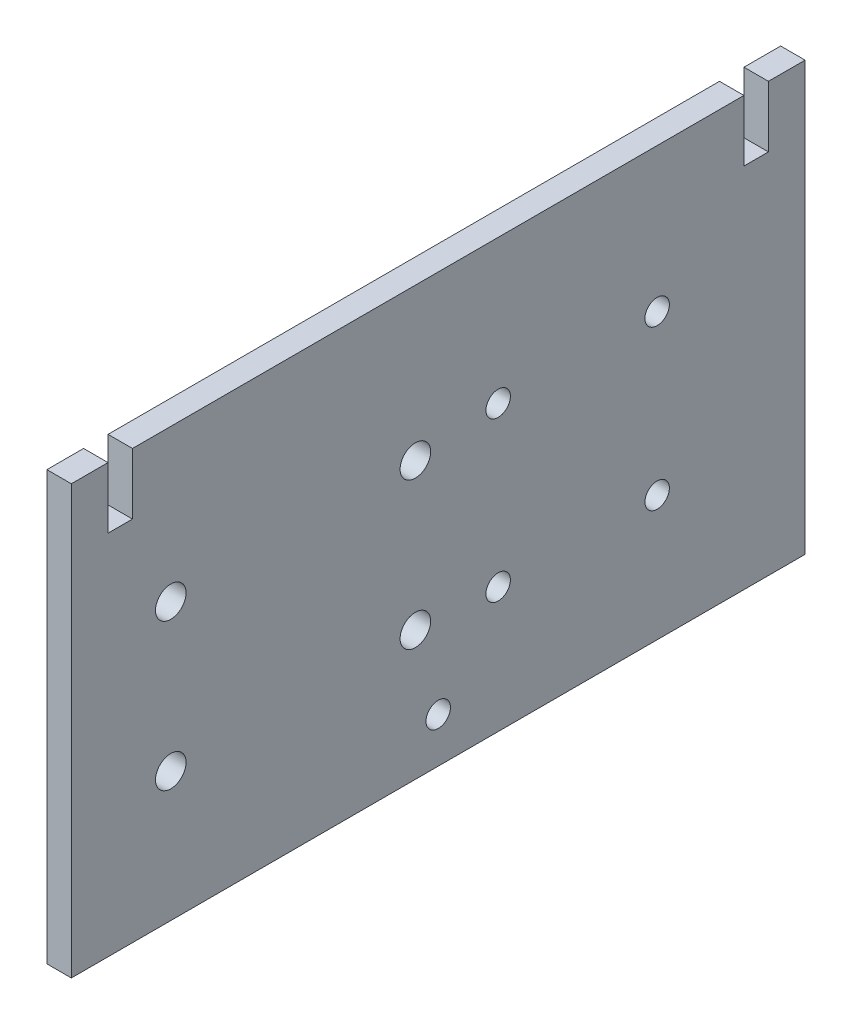
ISO-10303-21;
HEADER;
FILE_DESCRIPTION(('STEP AP214'),'2;1');
FILE_NAME('part.step','',(''),(''),'','','');
FILE_SCHEMA(('AUTOMOTIVE_DESIGN { 1 0 10303 214 1 1 1 1 }'));
ENDSEC;
DATA;
#1=APPLICATION_CONTEXT('core data for automotive mechanical design processes');
#2=APPLICATION_PROTOCOL_DEFINITION('international standard','automotive_design',2000,#1);
#3=PRODUCT_CONTEXT('',#1,'mechanical');
#4=PRODUCT('Part','Part','',(#3));
#5=PRODUCT_RELATED_PRODUCT_CATEGORY('part','',(#4));
#6=PRODUCT_DEFINITION_FORMATION('','',#4);
#7=PRODUCT_DEFINITION_CONTEXT('part definition',#1,'design');
#8=PRODUCT_DEFINITION('design','',#6,#7);
#9=PRODUCT_DEFINITION_SHAPE('','',#8);
#10=(LENGTH_UNIT() NAMED_UNIT(*) SI_UNIT(.MILLI.,.METRE.));
#11=(NAMED_UNIT(*) PLANE_ANGLE_UNIT() SI_UNIT($,.RADIAN.));
#12=(NAMED_UNIT(*) SI_UNIT($,.STERADIAN.) SOLID_ANGLE_UNIT());
#13=UNCERTAINTY_MEASURE_WITH_UNIT(LENGTH_MEASURE(1.E-05),#10,'distance_accuracy_value','');
#14=(GEOMETRIC_REPRESENTATION_CONTEXT(3) GLOBAL_UNCERTAINTY_ASSIGNED_CONTEXT((#13)) GLOBAL_UNIT_ASSIGNED_CONTEXT((#10,
#11,#12)) REPRESENTATION_CONTEXT('',''));
#15=CARTESIAN_POINT('',(0.,0.,0.));
#16=DIRECTION('',(0.,0.,1.));
#17=DIRECTION('',(1.,0.,0.));
#18=AXIS2_PLACEMENT_3D('',#15,#16,#17);
#19=CARTESIAN_POINT('',(4.,35.,60.));
#20=DIRECTION('',(0.,-1.,0.));
#21=DIRECTION('',(0.,0.,-1.));
#22=AXIS2_PLACEMENT_3D('',#19,#20,#21);
#23=PLANE('',#22);
#24=DIRECTION('',(0.,0.,1.));
#25=VECTOR('',#24,1.);
#26=CARTESIAN_POINT('',(4.,35.,60.));
#27=LINE('',#26,#25);
#28=CARTESIAN_POINT('',(4.,35.,-50.));
#29=VERTEX_POINT('',#28);
#30=CARTESIAN_POINT('',(4.,35.,50.));
#31=VERTEX_POINT('',#30);
#32=EDGE_CURVE('E196',#29,#31,#27,.T.);
#33=ORIENTED_EDGE('',*,*,#32,.F.);
#34=DIRECTION('',(1.,0.,0.));
#35=VECTOR('',#34,1.);
#36=CARTESIAN_POINT('',(0.,35.,-50.));
#37=LINE('',#36,#35);
#38=CARTESIAN_POINT('',(0.,35.,-50.));
#39=VERTEX_POINT('',#38);
#40=EDGE_CURVE('E156',#39,#29,#37,.T.);
#41=ORIENTED_EDGE('',*,*,#40,.F.);
#42=DIRECTION('',(0.,0.,1.));
#43=VECTOR('',#42,1.);
#44=CARTESIAN_POINT('',(0.,35.,60.));
#45=LINE('',#44,#43);
#46=CARTESIAN_POINT('',(0.,35.,50.));
#47=VERTEX_POINT('',#46);
#48=EDGE_CURVE('E143',#39,#47,#45,.T.);
#49=ORIENTED_EDGE('',*,*,#48,.T.);
#50=DIRECTION('',(1.,0.,0.));
#51=VECTOR('',#50,1.);
#52=CARTESIAN_POINT('',(0.,35.,50.));
#53=LINE('',#52,#51);
#54=EDGE_CURVE('E170',#47,#31,#53,.T.);
#55=ORIENTED_EDGE('',*,*,#54,.T.);
#56=EDGE_LOOP('',(#33,#41,#49,#55));
#57=FACE_BOUND('',#56,.T.);
#58=ADVANCED_FACE('F34',(#57),#23,.F.);
#59=CARTESIAN_POINT('',(0.,35.,-60.));
#60=VERTEX_POINT('',#59);
#61=CARTESIAN_POINT('',(0.,35.,-54.));
#62=VERTEX_POINT('',#61);
#63=EDGE_CURVE('E204',#60,#62,#45,.T.);
#64=ORIENTED_EDGE('',*,*,#63,.T.);
#65=DIRECTION('',(1.,0.,0.));
#66=VECTOR('',#65,1.);
#67=CARTESIAN_POINT('',(0.,35.,-54.));
#68=LINE('',#67,#66);
#69=CARTESIAN_POINT('',(4.,35.,-54.));
#70=VERTEX_POINT('',#69);
#71=EDGE_CURVE('E159',#62,#70,#68,.T.);
#72=ORIENTED_EDGE('',*,*,#71,.T.);
#73=CARTESIAN_POINT('',(4.,35.,-60.));
#74=VERTEX_POINT('',#73);
#75=EDGE_CURVE('E192',#74,#70,#27,.T.);
#76=ORIENTED_EDGE('',*,*,#75,.F.);
#77=DIRECTION('',(-1.,0.,0.));
#78=VECTOR('',#77,1.);
#79=CARTESIAN_POINT('',(4.,35.,-60.));
#80=LINE('',#79,#78);
#81=EDGE_CURVE('E11',#74,#60,#80,.T.);
#82=ORIENTED_EDGE('',*,*,#81,.T.);
#83=EDGE_LOOP('',(#64,#72,#76,#82));
#84=FACE_BOUND('',#83,.T.);
#85=ADVANCED_FACE('F260',(#84),#23,.F.);
#86=CARTESIAN_POINT('',(4.,-35.,-60.));
#87=DIRECTION('',(0.,0.,1.));
#88=DIRECTION('',(0.,-1.,0.));
#89=AXIS2_PLACEMENT_3D('',#86,#87,#88);
#90=PLANE('',#89);
#91=DIRECTION('',(0.,1.,0.));
#92=VECTOR('',#91,1.);
#93=CARTESIAN_POINT('',(0.,-35.,-60.));
#94=LINE('',#93,#92);
#95=CARTESIAN_POINT('',(0.,-35.,-60.));
#96=VERTEX_POINT('',#95);
#97=EDGE_CURVE('E180',#96,#60,#94,.T.);
#98=ORIENTED_EDGE('',*,*,#97,.T.);
#99=ORIENTED_EDGE('',*,*,#81,.F.);
#100=DIRECTION('',(0.,1.,0.));
#101=VECTOR('',#100,1.);
#102=CARTESIAN_POINT('',(4.,-35.,-60.));
#103=LINE('',#102,#101);
#104=CARTESIAN_POINT('',(4.,-35.,-60.));
#105=VERTEX_POINT('',#104);
#106=EDGE_CURVE('E187',#105,#74,#103,.T.);
#107=ORIENTED_EDGE('',*,*,#106,.F.);
#108=DIRECTION('',(-1.,0.,0.));
#109=VECTOR('',#108,1.);
#110=CARTESIAN_POINT('',(4.,-35.,-60.));
#111=LINE('',#110,#109);
#112=EDGE_CURVE('E200',#105,#96,#111,.T.);
#113=ORIENTED_EDGE('',*,*,#112,.T.);
#114=EDGE_LOOP('',(#98,#99,#107,#113));
#115=FACE_BOUND('',#114,.T.);
#116=ADVANCED_FACE('F36',(#115),#90,.F.);
#117=CARTESIAN_POINT('',(4.,35.,54.));
#118=VERTEX_POINT('',#117);
#119=CARTESIAN_POINT('',(4.,35.,60.));
#120=VERTEX_POINT('',#119);
#121=EDGE_CURVE('E190',#118,#120,#27,.T.);
#122=ORIENTED_EDGE('',*,*,#121,.F.);
#123=DIRECTION('',(1.,0.,0.));
#124=VECTOR('',#123,1.);
#125=CARTESIAN_POINT('',(0.,35.,54.));
#126=LINE('',#125,#124);
#127=CARTESIAN_POINT('',(0.,35.,54.));
#128=VERTEX_POINT('',#127);
#129=EDGE_CURVE('E183',#128,#118,#126,.T.);
#130=ORIENTED_EDGE('',*,*,#129,.F.);
#131=CARTESIAN_POINT('',(0.,35.,60.));
#132=VERTEX_POINT('',#131);
#133=EDGE_CURVE('E203',#128,#132,#45,.T.);
#134=ORIENTED_EDGE('',*,*,#133,.T.);
#135=DIRECTION('',(-1.,0.,0.));
#136=VECTOR('',#135,1.);
#137=CARTESIAN_POINT('',(4.,35.,60.));
#138=LINE('',#137,#136);
#139=EDGE_CURVE('E42',#120,#132,#138,.T.);
#140=ORIENTED_EDGE('',*,*,#139,.F.);
#141=EDGE_LOOP('',(#122,#130,#134,#140));
#142=FACE_BOUND('',#141,.T.);
#143=ADVANCED_FACE('F246',(#142),#23,.F.);
#144=CARTESIAN_POINT('',(4.,-35.,60.));
#145=DIRECTION('',(0.,0.,-1.));
#146=DIRECTION('',(0.,1.,0.));
#147=AXIS2_PLACEMENT_3D('',#144,#145,#146);
#148=PLANE('',#147);
#149=DIRECTION('',(0.,-1.,0.));
#150=VECTOR('',#149,1.);
#151=CARTESIAN_POINT('',(0.,-35.,60.));
#152=LINE('',#151,#150);
#153=CARTESIAN_POINT('',(0.,-35.,60.));
#154=VERTEX_POINT('',#153);
#155=EDGE_CURVE('E207',#132,#154,#152,.T.);
#156=ORIENTED_EDGE('',*,*,#155,.T.);
#157=DIRECTION('',(-1.,0.,0.));
#158=VECTOR('',#157,1.);
#159=CARTESIAN_POINT('',(4.,-35.,60.));
#160=LINE('',#159,#158);
#161=CARTESIAN_POINT('',(4.,-35.,60.));
#162=VERTEX_POINT('',#161);
#163=EDGE_CURVE('E212',#162,#154,#160,.T.);
#164=ORIENTED_EDGE('',*,*,#163,.F.);
#165=DIRECTION('',(0.,-1.,0.));
#166=VECTOR('',#165,1.);
#167=CARTESIAN_POINT('',(4.,-35.,60.));
#168=LINE('',#167,#166);
#169=EDGE_CURVE('E195',#120,#162,#168,.T.);
#170=ORIENTED_EDGE('',*,*,#169,.F.);
#171=ORIENTED_EDGE('',*,*,#139,.T.);
#172=EDGE_LOOP('',(#156,#164,#170,#171));
#173=FACE_BOUND('',#172,.T.);
#174=ADVANCED_FACE('F219',(#173),#148,.F.);
#175=CARTESIAN_POINT('',(4.,-35.,60.));
#176=DIRECTION('',(0.,1.,0.));
#177=DIRECTION('',(0.,0.,1.));
#178=AXIS2_PLACEMENT_3D('',#175,#176,#177);
#179=PLANE('',#178);
#180=DIRECTION('',(0.,0.,-1.));
#181=VECTOR('',#180,1.);
#182=CARTESIAN_POINT('',(0.,-35.,60.));
#183=LINE('',#182,#181);
#184=EDGE_CURVE('E191',#154,#96,#183,.T.);
#185=ORIENTED_EDGE('',*,*,#184,.T.);
#186=ORIENTED_EDGE('',*,*,#112,.F.);
#187=DIRECTION('',(0.,0.,-1.));
#188=VECTOR('',#187,1.);
#189=CARTESIAN_POINT('',(4.,-35.,60.));
#190=LINE('',#189,#188);
#191=EDGE_CURVE('E198',#162,#105,#190,.T.);
#192=ORIENTED_EDGE('',*,*,#191,.F.);
#193=ORIENTED_EDGE('',*,*,#163,.T.);
#194=EDGE_LOOP('',(#185,#186,#192,#193));
#195=FACE_BOUND('',#194,.T.);
#196=ADVANCED_FACE('F228',(#195),#179,.F.);
#197=CARTESIAN_POINT('',(4.,0.,0.));
#198=DIRECTION('',(-1.,0.,0.));
#199=DIRECTION('',(0.,0.,1.));
#200=AXIS2_PLACEMENT_3D('',#197,#198,#199);
#201=PLANE('',#200);
#202=CARTESIAN_POINT('',(4.,-14.506000467976,-9.80309809957087));
#203=DIRECTION('',(1.,0.,0.));
#204=DIRECTION('',(0.,0.,-1.));
#205=AXIS2_PLACEMENT_3D('',#202,#203,#204);
#206=CIRCLE('',#205,2.);
#207=CARTESIAN_POINT('',(4.,-14.506000467976,-11.8030980995709));
#208=VERTEX_POINT('',#207);
#209=EDGE_CURVE('E441',#208,#208,#206,.T.);
#210=ORIENTED_EDGE('',*,*,#209,.F.);
#211=EDGE_LOOP('',(#210));
#212=FACE_BOUND('',#211,.T.);
#213=CARTESIAN_POINT('',(4.,-14.506000467976,-35.8030980995709));
#214=DIRECTION('',(1.,0.,0.));
#215=DIRECTION('',(0.,0.,-1.));
#216=AXIS2_PLACEMENT_3D('',#213,#214,#215);
#217=CIRCLE('',#216,2.);
#218=CARTESIAN_POINT('',(4.,-14.506000467976,-37.8030980995709));
#219=VERTEX_POINT('',#218);
#220=EDGE_CURVE('E443',#219,#219,#217,.T.);
#221=ORIENTED_EDGE('',*,*,#220,.F.);
#222=EDGE_LOOP('',(#221));
#223=FACE_BOUND('',#222,.T.);
#224=CARTESIAN_POINT('',(4.,11.493999532024,-35.8030980995709));
#225=DIRECTION('',(1.,0.,0.));
#226=DIRECTION('',(0.,0.,-1.));
#227=AXIS2_PLACEMENT_3D('',#224,#225,#226);
#228=CIRCLE('',#227,2.);
#229=CARTESIAN_POINT('',(4.,11.493999532024,-37.8030980995709));
#230=VERTEX_POINT('',#229);
#231=EDGE_CURVE('E449',#230,#230,#228,.T.);
#232=ORIENTED_EDGE('',*,*,#231,.F.);
#233=EDGE_LOOP('',(#232));
#234=FACE_BOUND('',#233,.T.);
#235=CARTESIAN_POINT('',(4.,11.493999532024,-9.80309809957087));
#236=DIRECTION('',(1.,0.,0.));
#237=DIRECTION('',(0.,0.,-1.));
#238=AXIS2_PLACEMENT_3D('',#235,#236,#237);
#239=CIRCLE('',#238,2.);
#240=CARTESIAN_POINT('',(4.,11.493999532024,-11.8030980995709));
#241=VERTEX_POINT('',#240);
#242=EDGE_CURVE('E455',#241,#241,#239,.T.);
#243=ORIENTED_EDGE('',*,*,#242,.F.);
#244=EDGE_LOOP('',(#243));
#245=FACE_BOUND('',#244,.T.);
#246=CARTESIAN_POINT('',(4.,10.1722417389506,3.73750757894949));
#247=DIRECTION('',(1.,0.,0.));
#248=DIRECTION('',(0.,0.,-1.));
#249=AXIS2_PLACEMENT_3D('',#246,#247,#248);
#250=CIRCLE('',#249,2.5);
#251=CARTESIAN_POINT('',(4.,10.1722417389506,1.23750757894949));
#252=VERTEX_POINT('',#251);
#253=EDGE_CURVE('E461',#252,#252,#250,.T.);
#254=ORIENTED_EDGE('',*,*,#253,.F.);
#255=EDGE_LOOP('',(#254));
#256=FACE_BOUND('',#255,.T.);
#257=CARTESIAN_POINT('',(4.,-13.8277582610494,3.73750757894949));
#258=DIRECTION('',(1.,0.,0.));
#259=DIRECTION('',(0.,0.,-1.));
#260=AXIS2_PLACEMENT_3D('',#257,#258,#259);
#261=CIRCLE('',#260,2.5);
#262=CARTESIAN_POINT('',(4.,-13.8277582610494,1.23750757894949));
#263=VERTEX_POINT('',#262);
#264=EDGE_CURVE('E467',#263,#263,#261,.T.);
#265=ORIENTED_EDGE('',*,*,#264,.F.);
#266=EDGE_LOOP('',(#265));
#267=FACE_BOUND('',#266,.T.);
#268=CARTESIAN_POINT('',(4.,-13.8277582610494,43.7375075789495));
#269=DIRECTION('',(1.,0.,0.));
#270=DIRECTION('',(0.,0.,-1.));
#271=AXIS2_PLACEMENT_3D('',#268,#269,#270);
#272=CIRCLE('',#271,2.49999999999999);
#273=CARTESIAN_POINT('',(4.,-13.8277582610494,41.2375075789495));
#274=VERTEX_POINT('',#273);
#275=EDGE_CURVE('E473',#274,#274,#272,.T.);
#276=ORIENTED_EDGE('',*,*,#275,.F.);
#277=EDGE_LOOP('',(#276));
#278=FACE_BOUND('',#277,.T.);
#279=CARTESIAN_POINT('',(4.,10.1722417389506,43.7375075789495));
#280=DIRECTION('',(1.,0.,0.));
#281=DIRECTION('',(0.,0.,-1.));
#282=AXIS2_PLACEMENT_3D('',#279,#280,#281);
#283=CIRCLE('',#282,2.49999999999999);
#284=CARTESIAN_POINT('',(4.,10.1722417389506,41.2375075789495));
#285=VERTEX_POINT('',#284);
#286=EDGE_CURVE('E479',#285,#285,#283,.T.);
#287=ORIENTED_EDGE('',*,*,#286,.F.);
#288=EDGE_LOOP('',(#287));
#289=FACE_BOUND('',#288,.T.);
#290=CARTESIAN_POINT('',(4.,-27.6604928850881,0.));
#291=DIRECTION('',(1.,0.,0.));
#292=DIRECTION('',(0.,0.,-1.));
#293=AXIS2_PLACEMENT_3D('',#290,#291,#292);
#294=CIRCLE('',#293,2.);
#295=CARTESIAN_POINT('',(4.,-27.6604928850881,-2.));
#296=VERTEX_POINT('',#295);
#297=EDGE_CURVE('E149',#296,#296,#294,.T.);
#298=ORIENTED_EDGE('',*,*,#297,.F.);
#299=EDGE_LOOP('',(#298));
#300=FACE_BOUND('',#299,.T.);
#301=DIRECTION('',(0.,0.,-1.));
#302=VECTOR('',#301,1.);
#303=CARTESIAN_POINT('',(4.,25.,-50.));
#304=LINE('',#303,#302);
#305=CARTESIAN_POINT('',(4.,25.,-50.));
#306=VERTEX_POINT('',#305);
#307=CARTESIAN_POINT('',(4.,25.,-54.));
#308=VERTEX_POINT('',#307);
#309=EDGE_CURVE('E146',#306,#308,#304,.T.);
#310=ORIENTED_EDGE('',*,*,#309,.F.);
#311=DIRECTION('',(0.,-1.,0.));
#312=VECTOR('',#311,1.);
#313=CARTESIAN_POINT('',(4.,35.,-50.));
#314=LINE('',#313,#312);
#315=EDGE_CURVE('E129',#29,#306,#314,.T.);
#316=ORIENTED_EDGE('',*,*,#315,.F.);
#317=ORIENTED_EDGE('',*,*,#32,.T.);
#318=DIRECTION('',(0.,1.,0.));
#319=VECTOR('',#318,1.);
#320=CARTESIAN_POINT('',(4.,35.,50.));
#321=LINE('',#320,#319);
#322=CARTESIAN_POINT('',(4.,25.,50.));
#323=VERTEX_POINT('',#322);
#324=EDGE_CURVE('E158',#323,#31,#321,.T.);
#325=ORIENTED_EDGE('',*,*,#324,.F.);
#326=DIRECTION('',(0.,0.,-1.));
#327=VECTOR('',#326,1.);
#328=CARTESIAN_POINT('',(4.,25.,50.));
#329=LINE('',#328,#327);
#330=CARTESIAN_POINT('',(4.,25.,54.));
#331=VERTEX_POINT('',#330);
#332=EDGE_CURVE('E166',#331,#323,#329,.T.);
#333=ORIENTED_EDGE('',*,*,#332,.F.);
#334=DIRECTION('',(0.,-1.,0.));
#335=VECTOR('',#334,1.);
#336=CARTESIAN_POINT('',(4.,35.,54.));
#337=LINE('',#336,#335);
#338=EDGE_CURVE('E173',#118,#331,#337,.T.);
#339=ORIENTED_EDGE('',*,*,#338,.F.);
#340=ORIENTED_EDGE('',*,*,#121,.T.);
#341=ORIENTED_EDGE('',*,*,#169,.T.);
#342=ORIENTED_EDGE('',*,*,#191,.T.);
#343=ORIENTED_EDGE('',*,*,#106,.T.);
#344=ORIENTED_EDGE('',*,*,#75,.T.);
#345=DIRECTION('',(0.,1.,0.));
#346=VECTOR('',#345,1.);
#347=CARTESIAN_POINT('',(4.,35.,-54.));
#348=LINE('',#347,#346);
#349=EDGE_CURVE('E144',#308,#70,#348,.T.);
#350=ORIENTED_EDGE('',*,*,#349,.F.);
#351=EDGE_LOOP('',(#310,#316,#317,#325,#333,#339,#340,#341,#342,#343,#344,#350));
#352=FACE_BOUND('',#351,.T.);
#353=ADVANCED_FACE('F234',(#212,#223,#234,#245,#256,#267,#278,#289,#300,#352),#201,.F.);
#354=CARTESIAN_POINT('',(0.,0.,0.));
#355=DIRECTION('',(-1.,0.,0.));
#356=DIRECTION('',(0.,0.,1.));
#357=AXIS2_PLACEMENT_3D('',#354,#355,#356);
#358=PLANE('',#357);
#359=CARTESIAN_POINT('',(0.,-14.506000467976,-9.80309809957087));
#360=DIRECTION('',(1.,0.,0.));
#361=DIRECTION('',(0.,0.,-1.));
#362=AXIS2_PLACEMENT_3D('',#359,#360,#361);
#363=CIRCLE('',#362,2.);
#364=CARTESIAN_POINT('',(0.,-14.506000467976,-11.8030980995709));
#365=VERTEX_POINT('',#364);
#366=EDGE_CURVE('E438',#365,#365,#363,.T.);
#367=ORIENTED_EDGE('',*,*,#366,.T.);
#368=EDGE_LOOP('',(#367));
#369=FACE_BOUND('',#368,.T.);
#370=CARTESIAN_POINT('',(0.,-14.506000467976,-35.8030980995709));
#371=DIRECTION('',(1.,0.,0.));
#372=DIRECTION('',(0.,0.,-1.));
#373=AXIS2_PLACEMENT_3D('',#370,#371,#372);
#374=CIRCLE('',#373,2.);
#375=CARTESIAN_POINT('',(0.,-14.506000467976,-37.8030980995709));
#376=VERTEX_POINT('',#375);
#377=EDGE_CURVE('E446',#376,#376,#374,.T.);
#378=ORIENTED_EDGE('',*,*,#377,.T.);
#379=EDGE_LOOP('',(#378));
#380=FACE_BOUND('',#379,.T.);
#381=CARTESIAN_POINT('',(0.,11.493999532024,-35.8030980995709));
#382=DIRECTION('',(1.,0.,0.));
#383=DIRECTION('',(0.,0.,-1.));
#384=AXIS2_PLACEMENT_3D('',#381,#382,#383);
#385=CIRCLE('',#384,2.);
#386=CARTESIAN_POINT('',(0.,11.493999532024,-37.8030980995709));
#387=VERTEX_POINT('',#386);
#388=EDGE_CURVE('E452',#387,#387,#385,.T.);
#389=ORIENTED_EDGE('',*,*,#388,.T.);
#390=EDGE_LOOP('',(#389));
#391=FACE_BOUND('',#390,.T.);
#392=CARTESIAN_POINT('',(0.,11.493999532024,-9.80309809957087));
#393=DIRECTION('',(1.,0.,0.));
#394=DIRECTION('',(0.,0.,-1.));
#395=AXIS2_PLACEMENT_3D('',#392,#393,#394);
#396=CIRCLE('',#395,2.);
#397=CARTESIAN_POINT('',(0.,11.493999532024,-11.8030980995709));
#398=VERTEX_POINT('',#397);
#399=EDGE_CURVE('E458',#398,#398,#396,.T.);
#400=ORIENTED_EDGE('',*,*,#399,.T.);
#401=EDGE_LOOP('',(#400));
#402=FACE_BOUND('',#401,.T.);
#403=CARTESIAN_POINT('',(0.,10.1722417389506,3.73750757894949));
#404=DIRECTION('',(1.,0.,0.));
#405=DIRECTION('',(0.,0.,-1.));
#406=AXIS2_PLACEMENT_3D('',#403,#404,#405);
#407=CIRCLE('',#406,2.5);
#408=CARTESIAN_POINT('',(0.,10.1722417389506,1.23750757894949));
#409=VERTEX_POINT('',#408);
#410=EDGE_CURVE('E464',#409,#409,#407,.T.);
#411=ORIENTED_EDGE('',*,*,#410,.T.);
#412=EDGE_LOOP('',(#411));
#413=FACE_BOUND('',#412,.T.);
#414=CARTESIAN_POINT('',(0.,-13.8277582610494,3.73750757894949));
#415=DIRECTION('',(1.,0.,0.));
#416=DIRECTION('',(0.,0.,-1.));
#417=AXIS2_PLACEMENT_3D('',#414,#415,#416);
#418=CIRCLE('',#417,2.5);
#419=CARTESIAN_POINT('',(0.,-13.8277582610494,1.23750757894949));
#420=VERTEX_POINT('',#419);
#421=EDGE_CURVE('E470',#420,#420,#418,.T.);
#422=ORIENTED_EDGE('',*,*,#421,.T.);
#423=EDGE_LOOP('',(#422));
#424=FACE_BOUND('',#423,.T.);
#425=CARTESIAN_POINT('',(0.,-13.8277582610494,43.7375075789495));
#426=DIRECTION('',(1.,0.,0.));
#427=DIRECTION('',(0.,0.,-1.));
#428=AXIS2_PLACEMENT_3D('',#425,#426,#427);
#429=CIRCLE('',#428,2.49999999999999);
#430=CARTESIAN_POINT('',(0.,-13.8277582610494,41.2375075789495));
#431=VERTEX_POINT('',#430);
#432=EDGE_CURVE('E476',#431,#431,#429,.T.);
#433=ORIENTED_EDGE('',*,*,#432,.T.);
#434=EDGE_LOOP('',(#433));
#435=FACE_BOUND('',#434,.T.);
#436=CARTESIAN_POINT('',(0.,10.1722417389506,43.7375075789495));
#437=DIRECTION('',(1.,0.,0.));
#438=DIRECTION('',(0.,0.,-1.));
#439=AXIS2_PLACEMENT_3D('',#436,#437,#438);
#440=CIRCLE('',#439,2.49999999999999);
#441=CARTESIAN_POINT('',(0.,10.1722417389506,41.2375075789495));
#442=VERTEX_POINT('',#441);
#443=EDGE_CURVE('E482',#442,#442,#440,.T.);
#444=ORIENTED_EDGE('',*,*,#443,.T.);
#445=EDGE_LOOP('',(#444));
#446=FACE_BOUND('',#445,.T.);
#447=CARTESIAN_POINT('',(0.,-27.6604928850881,0.));
#448=DIRECTION('',(1.,0.,0.));
#449=DIRECTION('',(0.,0.,-1.));
#450=AXIS2_PLACEMENT_3D('',#447,#448,#449);
#451=CIRCLE('',#450,2.);
#452=CARTESIAN_POINT('',(0.,-27.6604928850881,-2.));
#453=VERTEX_POINT('',#452);
#454=EDGE_CURVE('E154',#453,#453,#451,.T.);
#455=ORIENTED_EDGE('',*,*,#454,.T.);
#456=EDGE_LOOP('',(#455));
#457=FACE_BOUND('',#456,.T.);
#458=DIRECTION('',(0.,-1.,0.));
#459=VECTOR('',#458,1.);
#460=CARTESIAN_POINT('',(0.,35.,-50.));
#461=LINE('',#460,#459);
#462=CARTESIAN_POINT('',(0.,25.,-50.));
#463=VERTEX_POINT('',#462);
#464=EDGE_CURVE('E126',#39,#463,#461,.T.);
#465=ORIENTED_EDGE('',*,*,#464,.T.);
#466=DIRECTION('',(0.,0.,-1.));
#467=VECTOR('',#466,1.);
#468=CARTESIAN_POINT('',(0.,25.,-50.));
#469=LINE('',#468,#467);
#470=CARTESIAN_POINT('',(0.,25.,-54.));
#471=VERTEX_POINT('',#470);
#472=EDGE_CURVE('E136',#463,#471,#469,.T.);
#473=ORIENTED_EDGE('',*,*,#472,.T.);
#474=DIRECTION('',(0.,1.,0.));
#475=VECTOR('',#474,1.);
#476=CARTESIAN_POINT('',(0.,35.,-54.));
#477=LINE('',#476,#475);
#478=EDGE_CURVE('E49',#471,#62,#477,.T.);
#479=ORIENTED_EDGE('',*,*,#478,.T.);
#480=ORIENTED_EDGE('',*,*,#63,.F.);
#481=ORIENTED_EDGE('',*,*,#97,.F.);
#482=ORIENTED_EDGE('',*,*,#184,.F.);
#483=ORIENTED_EDGE('',*,*,#155,.F.);
#484=ORIENTED_EDGE('',*,*,#133,.F.);
#485=DIRECTION('',(0.,-1.,0.));
#486=VECTOR('',#485,1.);
#487=CARTESIAN_POINT('',(0.,35.,54.));
#488=LINE('',#487,#486);
#489=CARTESIAN_POINT('',(0.,25.,54.));
#490=VERTEX_POINT('',#489);
#491=EDGE_CURVE('E165',#128,#490,#488,.T.);
#492=ORIENTED_EDGE('',*,*,#491,.T.);
#493=DIRECTION('',(0.,0.,-1.));
#494=VECTOR('',#493,1.);
#495=CARTESIAN_POINT('',(0.,25.,50.));
#496=LINE('',#495,#494);
#497=CARTESIAN_POINT('',(0.,25.,50.));
#498=VERTEX_POINT('',#497);
#499=EDGE_CURVE('E57',#490,#498,#496,.T.);
#500=ORIENTED_EDGE('',*,*,#499,.T.);
#501=DIRECTION('',(0.,1.,0.));
#502=VECTOR('',#501,1.);
#503=CARTESIAN_POINT('',(0.,35.,50.));
#504=LINE('',#503,#502);
#505=EDGE_CURVE('E163',#498,#47,#504,.T.);
#506=ORIENTED_EDGE('',*,*,#505,.T.);
#507=ORIENTED_EDGE('',*,*,#48,.F.);
#508=EDGE_LOOP('',(#465,#473,#479,#480,#481,#482,#483,#484,#492,#500,#506,#507));
#509=FACE_BOUND('',#508,.T.);
#510=ADVANCED_FACE('F141',(#369,#380,#391,#402,#413,#424,#435,#446,#457,#509),#358,.T.);
#511=CARTESIAN_POINT('',(0.,35.,50.));
#512=DIRECTION('',(0.,0.,-1.));
#513=DIRECTION('',(-1.,0.,0.));
#514=AXIS2_PLACEMENT_3D('',#511,#512,#513);
#515=PLANE('',#514);
#516=ORIENTED_EDGE('',*,*,#324,.T.);
#517=ORIENTED_EDGE('',*,*,#54,.F.);
#518=ORIENTED_EDGE('',*,*,#505,.F.);
#519=DIRECTION('',(1.,0.,0.));
#520=VECTOR('',#519,1.);
#521=CARTESIAN_POINT('',(0.,25.,50.));
#522=LINE('',#521,#520);
#523=EDGE_CURVE('E178',#498,#323,#522,.T.);
#524=ORIENTED_EDGE('',*,*,#523,.T.);
#525=EDGE_LOOP('',(#516,#517,#518,#524));
#526=FACE_BOUND('',#525,.T.);
#527=ADVANCED_FACE('F244',(#526),#515,.F.);
#528=CARTESIAN_POINT('',(0.,25.,50.));
#529=DIRECTION('',(0.,-1.,0.));
#530=DIRECTION('',(0.,0.,-1.));
#531=AXIS2_PLACEMENT_3D('',#528,#529,#530);
#532=PLANE('',#531);
#533=ORIENTED_EDGE('',*,*,#332,.T.);
#534=ORIENTED_EDGE('',*,*,#523,.F.);
#535=ORIENTED_EDGE('',*,*,#499,.F.);
#536=DIRECTION('',(1.,0.,0.));
#537=VECTOR('',#536,1.);
#538=CARTESIAN_POINT('',(0.,25.,54.));
#539=LINE('',#538,#537);
#540=EDGE_CURVE('E181',#490,#331,#539,.T.);
#541=ORIENTED_EDGE('',*,*,#540,.T.);
#542=EDGE_LOOP('',(#533,#534,#535,#541));
#543=FACE_BOUND('',#542,.T.);
#544=ADVANCED_FACE('F249',(#543),#532,.F.);
#545=CARTESIAN_POINT('',(0.,35.,54.));
#546=DIRECTION('',(0.,0.,1.));
#547=DIRECTION('',(1.,0.,0.));
#548=AXIS2_PLACEMENT_3D('',#545,#546,#547);
#549=PLANE('',#548);
#550=ORIENTED_EDGE('',*,*,#338,.T.);
#551=ORIENTED_EDGE('',*,*,#540,.F.);
#552=ORIENTED_EDGE('',*,*,#491,.F.);
#553=ORIENTED_EDGE('',*,*,#129,.T.);
#554=EDGE_LOOP('',(#550,#551,#552,#553));
#555=FACE_BOUND('',#554,.T.);
#556=ADVANCED_FACE('F248',(#555),#549,.F.);
#557=CARTESIAN_POINT('',(0.,35.,-50.));
#558=DIRECTION('',(0.,0.,1.));
#559=DIRECTION('',(1.,0.,0.));
#560=AXIS2_PLACEMENT_3D('',#557,#558,#559);
#561=PLANE('',#560);
#562=ORIENTED_EDGE('',*,*,#315,.T.);
#563=DIRECTION('',(1.,0.,0.));
#564=VECTOR('',#563,1.);
#565=CARTESIAN_POINT('',(0.,25.,-50.));
#566=LINE('',#565,#564);
#567=EDGE_CURVE('E122',#463,#306,#566,.T.);
#568=ORIENTED_EDGE('',*,*,#567,.F.);
#569=ORIENTED_EDGE('',*,*,#464,.F.);
#570=ORIENTED_EDGE('',*,*,#40,.T.);
#571=EDGE_LOOP('',(#562,#568,#569,#570));
#572=FACE_BOUND('',#571,.T.);
#573=ADVANCED_FACE('F124',(#572),#561,.F.);
#574=CARTESIAN_POINT('',(0.,35.,-54.));
#575=DIRECTION('',(0.,0.,-1.));
#576=DIRECTION('',(-1.,0.,0.));
#577=AXIS2_PLACEMENT_3D('',#574,#575,#576);
#578=PLANE('',#577);
#579=ORIENTED_EDGE('',*,*,#349,.T.);
#580=ORIENTED_EDGE('',*,*,#71,.F.);
#581=ORIENTED_EDGE('',*,*,#478,.F.);
#582=DIRECTION('',(1.,0.,0.));
#583=VECTOR('',#582,1.);
#584=CARTESIAN_POINT('',(0.,25.,-54.));
#585=LINE('',#584,#583);
#586=EDGE_CURVE('E133',#471,#308,#585,.T.);
#587=ORIENTED_EDGE('',*,*,#586,.T.);
#588=EDGE_LOOP('',(#579,#580,#581,#587));
#589=FACE_BOUND('',#588,.T.);
#590=ADVANCED_FACE('F313',(#589),#578,.F.);
#591=CARTESIAN_POINT('',(0.,25.,-50.));
#592=DIRECTION('',(0.,-1.,0.));
#593=DIRECTION('',(0.,0.,-1.));
#594=AXIS2_PLACEMENT_3D('',#591,#592,#593);
#595=PLANE('',#594);
#596=ORIENTED_EDGE('',*,*,#309,.T.);
#597=ORIENTED_EDGE('',*,*,#586,.F.);
#598=ORIENTED_EDGE('',*,*,#472,.F.);
#599=ORIENTED_EDGE('',*,*,#567,.T.);
#600=EDGE_LOOP('',(#596,#597,#598,#599));
#601=FACE_BOUND('',#600,.T.);
#602=ADVANCED_FACE('F137',(#601),#595,.F.);
#603=CARTESIAN_POINT('',(0.,-27.6604928850881,0.));
#604=DIRECTION('',(1.,0.,0.));
#605=DIRECTION('',(0.,0.,-1.));
#606=AXIS2_PLACEMENT_3D('',#603,#604,#605);
#607=CYLINDRICAL_SURFACE('',#606,2.);
#608=ORIENTED_EDGE('',*,*,#454,.F.);
#609=EDGE_LOOP('',(#608));
#610=FACE_BOUND('',#609,.T.);
#611=ORIENTED_EDGE('',*,*,#297,.T.);
#612=EDGE_LOOP('',(#611));
#613=FACE_BOUND('',#612,.T.);
#614=ADVANCED_FACE('F329',(#610,#613),#607,.F.);
#615=CARTESIAN_POINT('',(0.,10.1722417389506,43.7375075789495));
#616=DIRECTION('',(1.,0.,0.));
#617=DIRECTION('',(0.,0.,-1.));
#618=AXIS2_PLACEMENT_3D('',#615,#616,#617);
#619=CYLINDRICAL_SURFACE('',#618,2.49999999999999);
#620=ORIENTED_EDGE('',*,*,#443,.F.);
#621=EDGE_LOOP('',(#620));
#622=FACE_BOUND('',#621,.T.);
#623=ORIENTED_EDGE('',*,*,#286,.T.);
#624=EDGE_LOOP('',(#623));
#625=FACE_BOUND('',#624,.T.);
#626=ADVANCED_FACE('F338',(#622,#625),#619,.F.);
#627=CARTESIAN_POINT('',(0.,-13.8277582610494,43.7375075789495));
#628=DIRECTION('',(1.,0.,0.));
#629=DIRECTION('',(0.,0.,-1.));
#630=AXIS2_PLACEMENT_3D('',#627,#628,#629);
#631=CYLINDRICAL_SURFACE('',#630,2.49999999999999);
#632=ORIENTED_EDGE('',*,*,#432,.F.);
#633=EDGE_LOOP('',(#632));
#634=FACE_BOUND('',#633,.T.);
#635=ORIENTED_EDGE('',*,*,#275,.T.);
#636=EDGE_LOOP('',(#635));
#637=FACE_BOUND('',#636,.T.);
#638=ADVANCED_FACE('F361',(#634,#637),#631,.F.);
#639=CARTESIAN_POINT('',(0.,-13.8277582610494,3.73750757894949));
#640=DIRECTION('',(1.,0.,0.));
#641=DIRECTION('',(0.,0.,-1.));
#642=AXIS2_PLACEMENT_3D('',#639,#640,#641);
#643=CYLINDRICAL_SURFACE('',#642,2.5);
#644=ORIENTED_EDGE('',*,*,#421,.F.);
#645=EDGE_LOOP('',(#644));
#646=FACE_BOUND('',#645,.T.);
#647=ORIENTED_EDGE('',*,*,#264,.T.);
#648=EDGE_LOOP('',(#647));
#649=FACE_BOUND('',#648,.T.);
#650=ADVANCED_FACE('F371',(#646,#649),#643,.F.);
#651=CARTESIAN_POINT('',(0.,10.1722417389506,3.73750757894949));
#652=DIRECTION('',(1.,0.,0.));
#653=DIRECTION('',(0.,0.,-1.));
#654=AXIS2_PLACEMENT_3D('',#651,#652,#653);
#655=CYLINDRICAL_SURFACE('',#654,2.5);
#656=ORIENTED_EDGE('',*,*,#410,.F.);
#657=EDGE_LOOP('',(#656));
#658=FACE_BOUND('',#657,.T.);
#659=ORIENTED_EDGE('',*,*,#253,.T.);
#660=EDGE_LOOP('',(#659));
#661=FACE_BOUND('',#660,.T.);
#662=ADVANCED_FACE('F381',(#658,#661),#655,.F.);
#663=CARTESIAN_POINT('',(0.,11.493999532024,-9.80309809957087));
#664=DIRECTION('',(1.,0.,0.));
#665=DIRECTION('',(0.,0.,-1.));
#666=AXIS2_PLACEMENT_3D('',#663,#664,#665);
#667=CYLINDRICAL_SURFACE('',#666,2.);
#668=ORIENTED_EDGE('',*,*,#399,.F.);
#669=EDGE_LOOP('',(#668));
#670=FACE_BOUND('',#669,.T.);
#671=ORIENTED_EDGE('',*,*,#242,.T.);
#672=EDGE_LOOP('',(#671));
#673=FACE_BOUND('',#672,.T.);
#674=ADVANCED_FACE('F391',(#670,#673),#667,.F.);
#675=CARTESIAN_POINT('',(0.,11.493999532024,-35.8030980995709));
#676=DIRECTION('',(1.,0.,0.));
#677=DIRECTION('',(0.,0.,-1.));
#678=AXIS2_PLACEMENT_3D('',#675,#676,#677);
#679=CYLINDRICAL_SURFACE('',#678,2.);
#680=ORIENTED_EDGE('',*,*,#388,.F.);
#681=EDGE_LOOP('',(#680));
#682=FACE_BOUND('',#681,.T.);
#683=ORIENTED_EDGE('',*,*,#231,.T.);
#684=EDGE_LOOP('',(#683));
#685=FACE_BOUND('',#684,.T.);
#686=ADVANCED_FACE('F401',(#682,#685),#679,.F.);
#687=CARTESIAN_POINT('',(0.,-14.506000467976,-35.8030980995709));
#688=DIRECTION('',(1.,0.,0.));
#689=DIRECTION('',(0.,0.,-1.));
#690=AXIS2_PLACEMENT_3D('',#687,#688,#689);
#691=CYLINDRICAL_SURFACE('',#690,2.);
#692=ORIENTED_EDGE('',*,*,#377,.F.);
#693=EDGE_LOOP('',(#692));
#694=FACE_BOUND('',#693,.T.);
#695=ORIENTED_EDGE('',*,*,#220,.T.);
#696=EDGE_LOOP('',(#695));
#697=FACE_BOUND('',#696,.T.);
#698=ADVANCED_FACE('F411',(#694,#697),#691,.F.);
#699=CARTESIAN_POINT('',(0.,-14.506000467976,-9.80309809957087));
#700=DIRECTION('',(1.,0.,0.));
#701=DIRECTION('',(0.,0.,-1.));
#702=AXIS2_PLACEMENT_3D('',#699,#700,#701);
#703=CYLINDRICAL_SURFACE('',#702,2.);
#704=ORIENTED_EDGE('',*,*,#366,.F.);
#705=EDGE_LOOP('',(#704));
#706=FACE_BOUND('',#705,.T.);
#707=ORIENTED_EDGE('',*,*,#209,.T.);
#708=EDGE_LOOP('',(#707));
#709=FACE_BOUND('',#708,.T.);
#710=ADVANCED_FACE('F421',(#706,#709),#703,.F.);
#711=CLOSED_SHELL('',(#58,#85,#116,#143,#174,#196,#353,#510,#527,#544,#556,#573,#590,#602,#614,
#626,#638,#650,#662,#674,#686,#698,#710));
#712=MANIFOLD_SOLID_BREP('B2',#711);
#713=ADVANCED_BREP_SHAPE_REPRESENTATION('',(#18,#712),#14);
#714=SHAPE_DEFINITION_REPRESENTATION(#9,#713);
ENDSEC;
END-ISO-10303-21;
